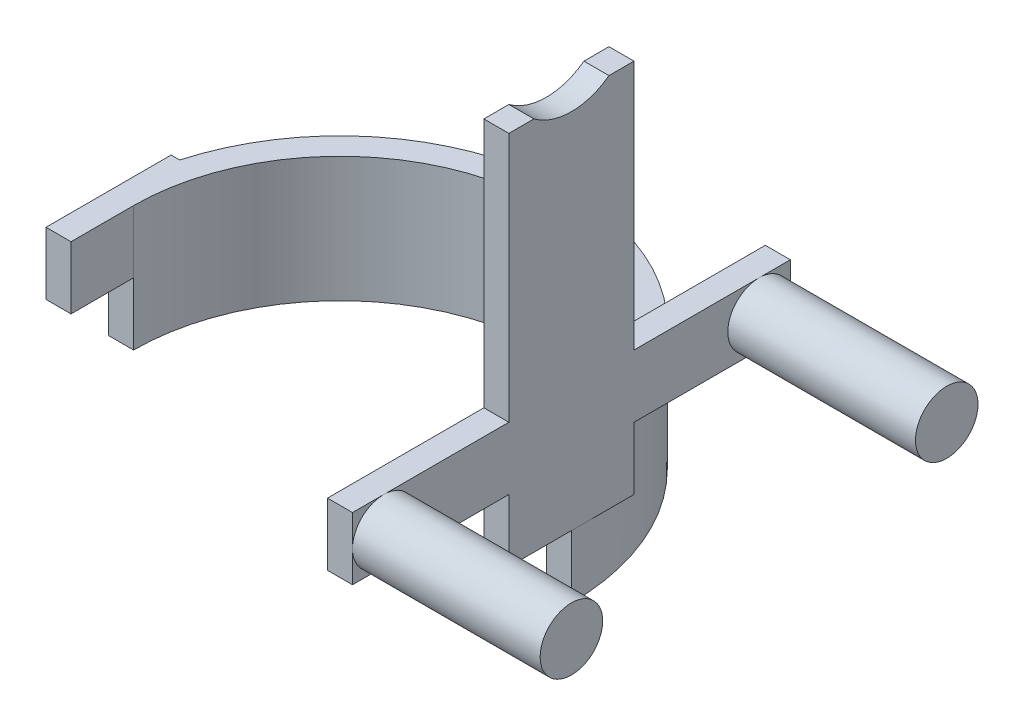
ISO-10303-21;
HEADER;
FILE_DESCRIPTION(('STEP AP214'),'2;1');
FILE_NAME('part.step','',(''),(''),'','','');
FILE_SCHEMA(('AUTOMOTIVE_DESIGN { 1 0 10303 214 1 1 1 1 }'));
ENDSEC;
DATA;
#1=APPLICATION_CONTEXT('core data for automotive mechanical design processes');
#2=APPLICATION_PROTOCOL_DEFINITION('international standard','automotive_design',2000,#1);
#3=PRODUCT_CONTEXT('',#1,'mechanical');
#4=PRODUCT('Part','Part','',(#3));
#5=PRODUCT_RELATED_PRODUCT_CATEGORY('part','',(#4));
#6=PRODUCT_DEFINITION_FORMATION('','',#4);
#7=PRODUCT_DEFINITION_CONTEXT('part definition',#1,'design');
#8=PRODUCT_DEFINITION('design','',#6,#7);
#9=PRODUCT_DEFINITION_SHAPE('','',#8);
#10=(LENGTH_UNIT() NAMED_UNIT(*) SI_UNIT(.MILLI.,.METRE.));
#11=(NAMED_UNIT(*) PLANE_ANGLE_UNIT() SI_UNIT($,.RADIAN.));
#12=(NAMED_UNIT(*) SI_UNIT($,.STERADIAN.) SOLID_ANGLE_UNIT());
#13=UNCERTAINTY_MEASURE_WITH_UNIT(LENGTH_MEASURE(1.E-05),#10,'distance_accuracy_value','');
#14=(GEOMETRIC_REPRESENTATION_CONTEXT(3) GLOBAL_UNCERTAINTY_ASSIGNED_CONTEXT((#13)) GLOBAL_UNIT_ASSIGNED_CONTEXT((#10,
#11,#12)) REPRESENTATION_CONTEXT('',''));
#15=CARTESIAN_POINT('',(0.,0.,0.));
#16=DIRECTION('',(0.,0.,1.));
#17=DIRECTION('',(1.,0.,0.));
#18=AXIS2_PLACEMENT_3D('',#15,#16,#17);
#19=CARTESIAN_POINT('',(74.,40.,-20.));
#20=DIRECTION('',(-1.,0.,0.));
#21=DIRECTION('',(0.,0.,1.));
#22=AXIS2_PLACEMENT_3D('',#19,#20,#21);
#23=PLANE('',#22);
#24=CARTESIAN_POINT('',(74.,50.,-60.));
#25=DIRECTION('',(1.,0.,0.));
#26=DIRECTION('',(0.,0.,-1.));
#27=AXIS2_PLACEMENT_3D('',#24,#25,#26);
#28=CIRCLE('',#27,9.99999999999999);
#29=CARTESIAN_POINT('',(74.,40.,-60.));
#30=VERTEX_POINT('',#29);
#31=CARTESIAN_POINT('',(74.,50.,-70.));
#32=VERTEX_POINT('',#31);
#33=EDGE_CURVE('E238',#30,#32,#28,.T.);
#34=ORIENTED_EDGE('',*,*,#33,.F.);
#35=DIRECTION('',(0.,0.,-1.));
#36=VECTOR('',#35,1.);
#37=CARTESIAN_POINT('',(74.,40.,-70.));
#38=LINE('',#37,#36);
#39=CARTESIAN_POINT('',(74.,40.,-70.));
#40=VERTEX_POINT('',#39);
#41=EDGE_CURVE('E224',#30,#40,#38,.T.);
#42=ORIENTED_EDGE('',*,*,#41,.T.);
#43=DIRECTION('',(0.,1.,0.));
#44=VECTOR('',#43,1.);
#45=CARTESIAN_POINT('',(74.,40.,-70.));
#46=LINE('',#45,#44);
#47=EDGE_CURVE('E239',#40,#32,#46,.T.);
#48=ORIENTED_EDGE('',*,*,#47,.T.);
#49=EDGE_LOOP('',(#34,#42,#48));
#50=FACE_BOUND('',#49,.T.);
#51=ADVANCED_FACE('F39',(#50),#23,.F.);
#52=CARTESIAN_POINT('',(74.,60.,-60.));
#53=VERTEX_POINT('',#52);
#54=EDGE_CURVE('E55',#32,#53,#28,.T.);
#55=ORIENTED_EDGE('',*,*,#54,.F.);
#56=CARTESIAN_POINT('',(74.,60.,-70.));
#57=VERTEX_POINT('',#56);
#58=EDGE_CURVE('E253',#32,#57,#46,.T.);
#59=ORIENTED_EDGE('',*,*,#58,.T.);
#60=DIRECTION('',(0.,0.,1.));
#61=VECTOR('',#60,1.);
#62=CARTESIAN_POINT('',(74.,60.,-70.));
#63=LINE('',#62,#61);
#64=EDGE_CURVE('E281',#57,#53,#63,.T.);
#65=ORIENTED_EDGE('',*,*,#64,.T.);
#66=EDGE_LOOP('',(#55,#59,#65));
#67=FACE_BOUND('',#66,.T.);
#68=ADVANCED_FACE('F547',(#67),#23,.F.);
#69=CARTESIAN_POINT('',(74.,50.,60.));
#70=DIRECTION('',(1.,0.,0.));
#71=DIRECTION('',(0.,0.,-1.));
#72=AXIS2_PLACEMENT_3D('',#69,#70,#71);
#73=CIRCLE('',#72,10.);
#74=CARTESIAN_POINT('',(74.,50.,70.));
#75=VERTEX_POINT('',#74);
#76=CARTESIAN_POINT('',(74.,40.,60.));
#77=VERTEX_POINT('',#76);
#78=EDGE_CURVE('E258',#75,#77,#73,.T.);
#79=ORIENTED_EDGE('',*,*,#78,.F.);
#80=DIRECTION('',(0.,-1.,0.));
#81=VECTOR('',#80,1.);
#82=CARTESIAN_POINT('',(74.,40.,70.));
#83=LINE('',#82,#81);
#84=CARTESIAN_POINT('',(74.,40.,70.));
#85=VERTEX_POINT('',#84);
#86=EDGE_CURVE('E284',#75,#85,#83,.T.);
#87=ORIENTED_EDGE('',*,*,#86,.T.);
#88=EDGE_CURVE('E226',#85,#77,#38,.T.);
#89=ORIENTED_EDGE('',*,*,#88,.T.);
#90=EDGE_LOOP('',(#79,#87,#89));
#91=FACE_BOUND('',#90,.T.);
#92=ADVANCED_FACE('F554',(#91),#23,.F.);
#93=EDGE_CURVE('E63',#53,#30,#28,.T.);
#94=ORIENTED_EDGE('',*,*,#93,.F.);
#95=CARTESIAN_POINT('',(74.,60.,-20.));
#96=VERTEX_POINT('',#95);
#97=EDGE_CURVE('E285',#53,#96,#63,.T.);
#98=ORIENTED_EDGE('',*,*,#97,.T.);
#99=DIRECTION('',(0.,-1.,0.));
#100=VECTOR('',#99,1.);
#101=CARTESIAN_POINT('',(74.,40.,-20.));
#102=LINE('',#101,#100);
#103=CARTESIAN_POINT('',(74.,140.,-20.));
#104=VERTEX_POINT('',#103);
#105=EDGE_CURVE('E464',#104,#96,#102,.T.);
#106=ORIENTED_EDGE('',*,*,#105,.F.);
#107=DIRECTION('',(0.,0.,-1.));
#108=VECTOR('',#107,1.);
#109=CARTESIAN_POINT('',(74.,140.,20.));
#110=LINE('',#109,#108);
#111=CARTESIAN_POINT('',(74.,140.,-12.));
#112=VERTEX_POINT('',#111);
#113=EDGE_CURVE('E410',#112,#104,#110,.T.);
#114=ORIENTED_EDGE('',*,*,#113,.F.);
#115=CARTESIAN_POINT('',(74.,156.,0.));
#116=DIRECTION('',(-1.,0.,0.));
#117=DIRECTION('',(0.,0.,1.));
#118=AXIS2_PLACEMENT_3D('',#115,#116,#117);
#119=CIRCLE('',#118,20.);
#120=CARTESIAN_POINT('',(74.,140.,12.));
#121=VERTEX_POINT('',#120);
#122=EDGE_CURVE('E392',#112,#121,#119,.T.);
#123=ORIENTED_EDGE('',*,*,#122,.T.);
#124=CARTESIAN_POINT('',(74.,140.,20.));
#125=VERTEX_POINT('',#124);
#126=EDGE_CURVE('E411',#125,#121,#110,.T.);
#127=ORIENTED_EDGE('',*,*,#126,.F.);
#128=DIRECTION('',(0.,-1.,0.));
#129=VECTOR('',#128,1.);
#130=CARTESIAN_POINT('',(74.,40.,20.));
#131=LINE('',#130,#129);
#132=CARTESIAN_POINT('',(74.,60.,20.));
#133=VERTEX_POINT('',#132);
#134=EDGE_CURVE('E469',#125,#133,#131,.T.);
#135=ORIENTED_EDGE('',*,*,#134,.T.);
#136=CARTESIAN_POINT('',(74.,60.,60.));
#137=VERTEX_POINT('',#136);
#138=EDGE_CURVE('E286',#133,#137,#63,.T.);
#139=ORIENTED_EDGE('',*,*,#138,.T.);
#140=EDGE_CURVE('E259',#77,#137,#73,.T.);
#141=ORIENTED_EDGE('',*,*,#140,.F.);
#142=CARTESIAN_POINT('',(74.,40.,20.));
#143=VERTEX_POINT('',#142);
#144=EDGE_CURVE('E223',#77,#143,#38,.T.);
#145=ORIENTED_EDGE('',*,*,#144,.T.);
#146=CARTESIAN_POINT('',(74.,20.,20.));
#147=VERTEX_POINT('',#146);
#148=EDGE_CURVE('E468',#143,#147,#131,.T.);
#149=ORIENTED_EDGE('',*,*,#148,.T.);
#150=DIRECTION('',(0.,0.,1.));
#151=VECTOR('',#150,1.);
#152=CARTESIAN_POINT('',(74.,20.,-20.));
#153=LINE('',#152,#151);
#154=CARTESIAN_POINT('',(74.,20.,0.));
#155=VERTEX_POINT('',#154);
#156=EDGE_CURVE('E381',#155,#147,#153,.T.);
#157=ORIENTED_EDGE('',*,*,#156,.F.);
#158=CARTESIAN_POINT('',(74.,20.,-20.));
#159=VERTEX_POINT('',#158);
#160=EDGE_CURVE('E378',#159,#155,#153,.T.);
#161=ORIENTED_EDGE('',*,*,#160,.F.);
#162=CARTESIAN_POINT('',(74.,40.,-20.));
#163=VERTEX_POINT('',#162);
#164=EDGE_CURVE('E219',#163,#159,#102,.T.);
#165=ORIENTED_EDGE('',*,*,#164,.F.);
#166=EDGE_CURVE('E215',#163,#30,#38,.T.);
#167=ORIENTED_EDGE('',*,*,#166,.T.);
#168=EDGE_LOOP('',(#94,#98,#106,#114,#123,#127,#135,#139,#141,#145,#149,#157,#161,#165,#167));
#169=FACE_BOUND('',#168,.T.);
#170=ADVANCED_FACE('F217',(#169),#23,.F.);
#171=CARTESIAN_POINT('',(74.,40.,20.));
#172=DIRECTION('',(0.,0.,-1.));
#173=DIRECTION('',(-1.,0.,0.));
#174=AXIS2_PLACEMENT_3D('',#171,#172,#173);
#175=PLANE('',#174);
#176=ORIENTED_EDGE('',*,*,#148,.F.);
#177=DIRECTION('',(-1.,0.,0.));
#178=VECTOR('',#177,1.);
#179=CARTESIAN_POINT('',(74.,40.,20.));
#180=LINE('',#179,#178);
#181=CARTESIAN_POINT('',(66.,40.,20.));
#182=VERTEX_POINT('',#181);
#183=EDGE_CURVE('E307',#143,#182,#180,.T.);
#184=ORIENTED_EDGE('',*,*,#183,.T.);
#185=DIRECTION('',(0.,-1.,0.));
#186=VECTOR('',#185,1.);
#187=CARTESIAN_POINT('',(66.,40.,20.));
#188=LINE('',#187,#186);
#189=CARTESIAN_POINT('',(66.,20.,20.));
#190=VERTEX_POINT('',#189);
#191=EDGE_CURVE('E473',#182,#190,#188,.T.);
#192=ORIENTED_EDGE('',*,*,#191,.T.);
#193=DIRECTION('',(1.,0.,0.));
#194=VECTOR('',#193,1.);
#195=CARTESIAN_POINT('',(71.2460525222275,20.,20.));
#196=LINE('',#195,#194);
#197=EDGE_CURVE('E342',#190,#147,#196,.T.);
#198=ORIENTED_EDGE('',*,*,#197,.T.);
#199=EDGE_LOOP('',(#176,#184,#192,#198));
#200=FACE_BOUND('',#199,.T.);
#201=ADVANCED_FACE('F572',(#200),#175,.F.);
#202=CARTESIAN_POINT('',(74.,40.,-20.));
#203=DIRECTION('',(0.,0.,1.));
#204=DIRECTION('',(1.,0.,0.));
#205=AXIS2_PLACEMENT_3D('',#202,#203,#204);
#206=PLANE('',#205);
#207=DIRECTION('',(0.,-1.,0.));
#208=VECTOR('',#207,1.);
#209=CARTESIAN_POINT('',(71.2460525222275,40.,-20.));
#210=LINE('',#209,#208);
#211=CARTESIAN_POINT('',(71.2460525222275,40.,-20.));
#212=VERTEX_POINT('',#211);
#213=CARTESIAN_POINT('',(71.2460525222275,20.,-20.));
#214=VERTEX_POINT('',#213);
#215=EDGE_CURVE('E460',#212,#214,#210,.T.);
#216=ORIENTED_EDGE('',*,*,#215,.F.);
#217=DIRECTION('',(1.,0.,0.));
#218=VECTOR('',#217,1.);
#219=CARTESIAN_POINT('',(74.,40.,-20.));
#220=LINE('',#219,#218);
#221=EDGE_CURVE('E293',#212,#163,#220,.T.);
#222=ORIENTED_EDGE('',*,*,#221,.T.);
#223=ORIENTED_EDGE('',*,*,#164,.T.);
#224=DIRECTION('',(1.,0.,0.));
#225=VECTOR('',#224,1.);
#226=CARTESIAN_POINT('',(74.,20.,-20.));
#227=LINE('',#226,#225);
#228=EDGE_CURVE('E374',#214,#159,#227,.T.);
#229=ORIENTED_EDGE('',*,*,#228,.F.);
#230=EDGE_LOOP('',(#216,#222,#223,#229));
#231=FACE_BOUND('',#230,.T.);
#232=ADVANCED_FACE('F568',(#231),#206,.F.);
#233=CARTESIAN_POINT('',(0.,40.,0.));
#234=DIRECTION('',(0.,1.,0.));
#235=DIRECTION('',(0.,0.,1.));
#236=AXIS2_PLACEMENT_3D('',#233,#234,#235);
#237=PLANE('',#236);
#238=DIRECTION('',(0.,0.,1.));
#239=VECTOR('',#238,1.);
#240=CARTESIAN_POINT('',(66.,40.,20.));
#241=LINE('',#240,#239);
#242=CARTESIAN_POINT('',(66.,40.,-33.466401061363));
#243=VERTEX_POINT('',#242);
#244=CARTESIAN_POINT('',(66.,40.,0.));
#245=VERTEX_POINT('',#244);
#246=EDGE_CURVE('E400',#243,#245,#241,.T.);
#247=ORIENTED_EDGE('',*,*,#246,.F.);
#248=CARTESIAN_POINT('',(0.,40.,0.));
#249=DIRECTION('',(0.,1.,0.));
#250=DIRECTION('',(0.,0.,1.));
#251=AXIS2_PLACEMENT_3D('',#248,#249,#250);
#252=CIRCLE('',#251,74.);
#253=CARTESIAN_POINT('',(-71.2460525222275,40.,-20.));
#254=VERTEX_POINT('',#253);
#255=EDGE_CURVE('E429',#243,#254,#252,.T.);
#256=ORIENTED_EDGE('',*,*,#255,.T.);
#257=DIRECTION('',(-1.,0.,0.));
#258=VECTOR('',#257,1.);
#259=CARTESIAN_POINT('',(-64.,40.,-20.));
#260=LINE('',#259,#258);
#261=CARTESIAN_POINT('',(-74.,40.,-20.));
#262=VERTEX_POINT('',#261);
#263=EDGE_CURVE('E385',#254,#262,#260,.T.);
#264=ORIENTED_EDGE('',*,*,#263,.T.);
#265=DIRECTION('',(0.,0.,1.));
#266=VECTOR('',#265,1.);
#267=CARTESIAN_POINT('',(-74.,40.,-20.));
#268=LINE('',#267,#266);
#269=CARTESIAN_POINT('',(-74.,40.,20.));
#270=VERTEX_POINT('',#269);
#271=EDGE_CURVE('E382',#262,#270,#268,.T.);
#272=ORIENTED_EDGE('',*,*,#271,.T.);
#273=DIRECTION('',(-1.,0.,0.));
#274=VECTOR('',#273,1.);
#275=CARTESIAN_POINT('',(-74.,40.,20.));
#276=LINE('',#275,#274);
#277=CARTESIAN_POINT('',(-66.,40.,20.));
#278=VERTEX_POINT('',#277);
#279=EDGE_CURVE('E388',#278,#270,#276,.T.);
#280=ORIENTED_EDGE('',*,*,#279,.F.);
#281=DIRECTION('',(0.,0.,1.));
#282=VECTOR('',#281,1.);
#283=CARTESIAN_POINT('',(-66.,40.,0.));
#284=LINE('',#283,#282);
#285=CARTESIAN_POINT('',(-66.,40.,0.));
#286=VERTEX_POINT('',#285);
#287=EDGE_CURVE('E48',#286,#278,#284,.T.);
#288=ORIENTED_EDGE('',*,*,#287,.F.);
#289=CARTESIAN_POINT('',(0.,40.,0.));
#290=DIRECTION('',(0.,-1.,0.));
#291=DIRECTION('',(0.,0.,1.));
#292=AXIS2_PLACEMENT_3D('',#289,#290,#291);
#293=CIRCLE('',#292,66.);
#294=EDGE_CURVE('E426',#286,#245,#293,.T.);
#295=ORIENTED_EDGE('',*,*,#294,.T.);
#296=EDGE_LOOP('',(#247,#256,#264,#272,#280,#288,#295));
#297=FACE_BOUND('',#296,.T.);
#298=ADVANCED_FACE('F674',(#297),#237,.T.);
#299=CARTESIAN_POINT('',(66.,40.,0.));
#300=DIRECTION('',(1.,0.,0.));
#301=DIRECTION('',(0.,0.,-1.));
#302=AXIS2_PLACEMENT_3D('',#299,#300,#301);
#303=PLANE('',#302);
#304=DIRECTION('',(0.,-1.,0.));
#305=VECTOR('',#304,1.);
#306=CARTESIAN_POINT('',(66.,140.,-20.));
#307=LINE('',#306,#305);
#308=CARTESIAN_POINT('',(66.,140.,-20.));
#309=VERTEX_POINT('',#308);
#310=CARTESIAN_POINT('',(66.,60.,-20.));
#311=VERTEX_POINT('',#310);
#312=EDGE_CURVE('E418',#309,#311,#307,.T.);
#313=ORIENTED_EDGE('',*,*,#312,.T.);
#314=DIRECTION('',(0.,0.,1.));
#315=VECTOR('',#314,1.);
#316=CARTESIAN_POINT('',(66.,60.,-70.));
#317=LINE('',#316,#315);
#318=CARTESIAN_POINT('',(66.,60.,-70.));
#319=VERTEX_POINT('',#318);
#320=EDGE_CURVE('E265',#319,#311,#317,.T.);
#321=ORIENTED_EDGE('',*,*,#320,.F.);
#322=DIRECTION('',(0.,1.,0.));
#323=VECTOR('',#322,1.);
#324=CARTESIAN_POINT('',(66.,40.,-70.));
#325=LINE('',#324,#323);
#326=CARTESIAN_POINT('',(66.,40.,-70.));
#327=VERTEX_POINT('',#326);
#328=EDGE_CURVE('E260',#327,#319,#325,.T.);
#329=ORIENTED_EDGE('',*,*,#328,.F.);
#330=DIRECTION('',(0.,0.,-1.));
#331=VECTOR('',#330,1.);
#332=CARTESIAN_POINT('',(66.,40.,-70.));
#333=LINE('',#332,#331);
#334=EDGE_CURVE('E273',#243,#327,#333,.T.);
#335=ORIENTED_EDGE('',*,*,#334,.F.);
#336=ORIENTED_EDGE('',*,*,#246,.T.);
#337=DIRECTION('',(0.,-1.,0.));
#338=VECTOR('',#337,1.);
#339=CARTESIAN_POINT('',(66.,40.,0.));
#340=LINE('',#339,#338);
#341=CARTESIAN_POINT('',(66.,20.,0.));
#342=VERTEX_POINT('',#341);
#343=EDGE_CURVE('E478',#245,#342,#340,.T.);
#344=ORIENTED_EDGE('',*,*,#343,.T.);
#345=DIRECTION('',(0.,0.,1.));
#346=VECTOR('',#345,1.);
#347=CARTESIAN_POINT('',(66.,20.,20.));
#348=LINE('',#347,#346);
#349=EDGE_CURVE('E338',#342,#190,#348,.T.);
#350=ORIENTED_EDGE('',*,*,#349,.T.);
#351=ORIENTED_EDGE('',*,*,#191,.F.);
#352=CARTESIAN_POINT('',(66.,40.,70.));
#353=VERTEX_POINT('',#352);
#354=EDGE_CURVE('E274',#353,#182,#333,.T.);
#355=ORIENTED_EDGE('',*,*,#354,.F.);
#356=DIRECTION('',(0.,-1.,0.));
#357=VECTOR('',#356,1.);
#358=CARTESIAN_POINT('',(66.,40.,70.));
#359=LINE('',#358,#357);
#360=CARTESIAN_POINT('',(66.,60.,70.));
#361=VERTEX_POINT('',#360);
#362=EDGE_CURVE('E269',#361,#353,#359,.T.);
#363=ORIENTED_EDGE('',*,*,#362,.F.);
#364=CARTESIAN_POINT('',(66.,60.,20.));
#365=VERTEX_POINT('',#364);
#366=EDGE_CURVE('E264',#365,#361,#317,.T.);
#367=ORIENTED_EDGE('',*,*,#366,.F.);
#368=CARTESIAN_POINT('',(66.,140.,20.));
#369=VERTEX_POINT('',#368);
#370=EDGE_CURVE('E474',#369,#365,#188,.T.);
#371=ORIENTED_EDGE('',*,*,#370,.F.);
#372=DIRECTION('',(0.,0.,1.));
#373=VECTOR('',#372,1.);
#374=CARTESIAN_POINT('',(66.,140.,20.));
#375=LINE('',#374,#373);
#376=CARTESIAN_POINT('',(66.,140.,12.));
#377=VERTEX_POINT('',#376);
#378=EDGE_CURVE('E406',#377,#369,#375,.T.);
#379=ORIENTED_EDGE('',*,*,#378,.F.);
#380=CARTESIAN_POINT('',(66.,156.,0.));
#381=DIRECTION('',(1.,0.,0.));
#382=DIRECTION('',(0.,0.,-1.));
#383=AXIS2_PLACEMENT_3D('',#380,#381,#382);
#384=CIRCLE('',#383,20.);
#385=CARTESIAN_POINT('',(66.,140.,-12.));
#386=VERTEX_POINT('',#385);
#387=EDGE_CURVE('E396',#377,#386,#384,.T.);
#388=ORIENTED_EDGE('',*,*,#387,.T.);
#389=EDGE_CURVE('E401',#309,#386,#375,.T.);
#390=ORIENTED_EDGE('',*,*,#389,.F.);
#391=EDGE_LOOP('',(#313,#321,#329,#335,#336,#344,#350,#351,#355,#363,#367,#371,#379,#388,#390));
#392=FACE_BOUND('',#391,.T.);
#393=ADVANCED_FACE('F570',(#392),#303,.F.);
#394=ORIENTED_EDGE('',*,*,#370,.T.);
#395=DIRECTION('',(1.,0.,0.));
#396=VECTOR('',#395,1.);
#397=CARTESIAN_POINT('',(74.,60.,20.));
#398=LINE('',#397,#396);
#399=EDGE_CURVE('E311',#365,#133,#398,.T.);
#400=ORIENTED_EDGE('',*,*,#399,.T.);
#401=ORIENTED_EDGE('',*,*,#134,.F.);
#402=DIRECTION('',(1.,0.,0.));
#403=VECTOR('',#402,1.);
#404=CARTESIAN_POINT('',(66.,140.,20.));
#405=LINE('',#404,#403);
#406=EDGE_CURVE('E405',#369,#125,#405,.T.);
#407=ORIENTED_EDGE('',*,*,#406,.F.);
#408=EDGE_LOOP('',(#394,#400,#401,#407));
#409=FACE_BOUND('',#408,.T.);
#410=ADVANCED_FACE('F559',(#409),#175,.F.);
#411=EDGE_CURVE('E254',#137,#75,#73,.T.);
#412=ORIENTED_EDGE('',*,*,#411,.F.);
#413=CARTESIAN_POINT('',(74.,60.,70.));
#414=VERTEX_POINT('',#413);
#415=EDGE_CURVE('E280',#137,#414,#63,.T.);
#416=ORIENTED_EDGE('',*,*,#415,.T.);
#417=EDGE_CURVE('E236',#414,#75,#83,.T.);
#418=ORIENTED_EDGE('',*,*,#417,.T.);
#419=EDGE_LOOP('',(#412,#416,#418));
#420=FACE_BOUND('',#419,.T.);
#421=ADVANCED_FACE('F549',(#420),#23,.F.);
#422=ORIENTED_EDGE('',*,*,#105,.T.);
#423=DIRECTION('',(-1.,0.,0.));
#424=VECTOR('',#423,1.);
#425=CARTESIAN_POINT('',(74.,60.,-20.));
#426=LINE('',#425,#424);
#427=EDGE_CURVE('E11',#96,#311,#426,.T.);
#428=ORIENTED_EDGE('',*,*,#427,.T.);
#429=ORIENTED_EDGE('',*,*,#312,.F.);
#430=DIRECTION('',(-1.,0.,0.));
#431=VECTOR('',#430,1.);
#432=CARTESIAN_POINT('',(66.,140.,-20.));
#433=LINE('',#432,#431);
#434=EDGE_CURVE('E415',#104,#309,#433,.T.);
#435=ORIENTED_EDGE('',*,*,#434,.F.);
#436=EDGE_LOOP('',(#422,#428,#429,#435));
#437=FACE_BOUND('',#436,.T.);
#438=ADVANCED_FACE('F558',(#437),#206,.F.);
#439=CARTESIAN_POINT('',(-74.,40.,-20.));
#440=DIRECTION('',(0.,0.,1.));
#441=DIRECTION('',(1.,0.,0.));
#442=AXIS2_PLACEMENT_3D('',#439,#440,#441);
#443=PLANE('',#442);
#444=DIRECTION('',(1.,0.,0.));
#445=VECTOR('',#444,1.);
#446=CARTESIAN_POINT('',(-74.,20.,-20.));
#447=LINE('',#446,#445);
#448=CARTESIAN_POINT('',(-74.,20.,-20.));
#449=VERTEX_POINT('',#448);
#450=CARTESIAN_POINT('',(-71.2460525222275,20.,-20.));
#451=VERTEX_POINT('',#450);
#452=EDGE_CURVE('E371',#449,#451,#447,.T.);
#453=ORIENTED_EDGE('',*,*,#452,.F.);
#454=DIRECTION('',(0.,-1.,0.));
#455=VECTOR('',#454,1.);
#456=CARTESIAN_POINT('',(-74.,40.,-20.));
#457=LINE('',#456,#455);
#458=EDGE_CURVE('E452',#262,#449,#457,.T.);
#459=ORIENTED_EDGE('',*,*,#458,.F.);
#460=ORIENTED_EDGE('',*,*,#263,.F.);
#461=DIRECTION('',(0.,-1.,0.));
#462=VECTOR('',#461,1.);
#463=CARTESIAN_POINT('',(-71.2460525222275,40.,-20.));
#464=LINE('',#463,#462);
#465=EDGE_CURVE('E456',#254,#451,#464,.T.);
#466=ORIENTED_EDGE('',*,*,#465,.T.);
#467=EDGE_LOOP('',(#453,#459,#460,#466));
#468=FACE_BOUND('',#467,.T.);
#469=ADVANCED_FACE('F566',(#468),#443,.F.);
#470=CARTESIAN_POINT('',(-74.,40.,-20.));
#471=DIRECTION('',(1.,0.,0.));
#472=DIRECTION('',(0.,0.,-1.));
#473=AXIS2_PLACEMENT_3D('',#470,#471,#472);
#474=PLANE('',#473);
#475=DIRECTION('',(0.,0.,-1.));
#476=VECTOR('',#475,1.);
#477=CARTESIAN_POINT('',(-74.,20.,-20.));
#478=LINE('',#477,#476);
#479=CARTESIAN_POINT('',(-74.,20.,20.));
#480=VERTEX_POINT('',#479);
#481=CARTESIAN_POINT('',(-74.,20.,0.));
#482=VERTEX_POINT('',#481);
#483=EDGE_CURVE('E356',#480,#482,#478,.T.);
#484=ORIENTED_EDGE('',*,*,#483,.F.);
#485=DIRECTION('',(0.,-1.,0.));
#486=VECTOR('',#485,1.);
#487=CARTESIAN_POINT('',(-74.,40.,20.));
#488=LINE('',#487,#486);
#489=EDGE_CURVE('E448',#270,#480,#488,.T.);
#490=ORIENTED_EDGE('',*,*,#489,.F.);
#491=ORIENTED_EDGE('',*,*,#271,.F.);
#492=ORIENTED_EDGE('',*,*,#458,.T.);
#493=EDGE_CURVE('E370',#482,#449,#478,.T.);
#494=ORIENTED_EDGE('',*,*,#493,.F.);
#495=EDGE_LOOP('',(#484,#490,#491,#492,#494));
#496=FACE_BOUND('',#495,.T.);
#497=ADVANCED_FACE('F507',(#496),#474,.F.);
#498=CARTESIAN_POINT('',(-74.,40.,20.));
#499=DIRECTION('',(0.,0.,-1.));
#500=DIRECTION('',(-1.,0.,0.));
#501=AXIS2_PLACEMENT_3D('',#498,#499,#500);
#502=PLANE('',#501);
#503=DIRECTION('',(1.,0.,0.));
#504=VECTOR('',#503,1.);
#505=CARTESIAN_POINT('',(-71.2460525222275,20.,20.));
#506=LINE('',#505,#504);
#507=CARTESIAN_POINT('',(-66.,20.,20.));
#508=VERTEX_POINT('',#507);
#509=EDGE_CURVE('E316',#480,#508,#506,.T.);
#510=ORIENTED_EDGE('',*,*,#509,.T.);
#511=DIRECTION('',(0.,-1.,0.));
#512=VECTOR('',#511,1.);
#513=CARTESIAN_POINT('',(-66.,40.,20.));
#514=LINE('',#513,#512);
#515=EDGE_CURVE('E444',#278,#508,#514,.T.);
#516=ORIENTED_EDGE('',*,*,#515,.F.);
#517=ORIENTED_EDGE('',*,*,#279,.T.);
#518=ORIENTED_EDGE('',*,*,#489,.T.);
#519=EDGE_LOOP('',(#510,#516,#517,#518));
#520=FACE_BOUND('',#519,.T.);
#521=ADVANCED_FACE('F498',(#520),#502,.F.);
#522=CARTESIAN_POINT('',(-66.,40.,0.));
#523=DIRECTION('',(-1.,0.,0.));
#524=DIRECTION('',(0.,0.,1.));
#525=AXIS2_PLACEMENT_3D('',#522,#523,#524);
#526=PLANE('',#525);
#527=DIRECTION('',(0.,0.,-1.));
#528=VECTOR('',#527,1.);
#529=CARTESIAN_POINT('',(-66.,20.,20.));
#530=LINE('',#529,#528);
#531=CARTESIAN_POINT('',(-66.,20.,0.));
#532=VERTEX_POINT('',#531);
#533=EDGE_CURVE('E320',#508,#532,#530,.T.);
#534=ORIENTED_EDGE('',*,*,#533,.T.);
#535=DIRECTION('',(0.,-1.,0.));
#536=VECTOR('',#535,1.);
#537=CARTESIAN_POINT('',(-66.,40.,0.));
#538=LINE('',#537,#536);
#539=EDGE_CURVE('E435',#286,#532,#538,.T.);
#540=ORIENTED_EDGE('',*,*,#539,.F.);
#541=ORIENTED_EDGE('',*,*,#287,.T.);
#542=ORIENTED_EDGE('',*,*,#515,.T.);
#543=EDGE_LOOP('',(#534,#540,#541,#542));
#544=FACE_BOUND('',#543,.T.);
#545=ADVANCED_FACE('F494',(#544),#526,.F.);
#546=CARTESIAN_POINT('',(0.,0.,0.));
#547=DIRECTION('',(0.,1.,0.));
#548=DIRECTION('',(0.,0.,1.));
#549=AXIS2_PLACEMENT_3D('',#546,#547,#548);
#550=PLANE('',#549);
#551=DIRECTION('',(-1.,0.,0.));
#552=VECTOR('',#551,1.);
#553=CARTESIAN_POINT('',(74.,0.,0.));
#554=LINE('',#553,#552);
#555=CARTESIAN_POINT('',(74.,0.,0.));
#556=VERTEX_POINT('',#555);
#557=CARTESIAN_POINT('',(66.,0.,0.));
#558=VERTEX_POINT('',#557);
#559=EDGE_CURVE('E321',#556,#558,#554,.T.);
#560=ORIENTED_EDGE('',*,*,#559,.T.);
#561=CARTESIAN_POINT('',(0.,0.,0.));
#562=DIRECTION('',(0.,-1.,0.));
#563=DIRECTION('',(0.,0.,1.));
#564=AXIS2_PLACEMENT_3D('',#561,#562,#563);
#565=CIRCLE('',#564,66.);
#566=CARTESIAN_POINT('',(-66.,0.,0.));
#567=VERTEX_POINT('',#566);
#568=EDGE_CURVE('E425',#567,#558,#565,.T.);
#569=ORIENTED_EDGE('',*,*,#568,.F.);
#570=DIRECTION('',(-1.,0.,0.));
#571=VECTOR('',#570,1.);
#572=CARTESIAN_POINT('',(-74.,0.,0.));
#573=LINE('',#572,#571);
#574=CARTESIAN_POINT('',(-74.,0.,0.));
#575=VERTEX_POINT('',#574);
#576=EDGE_CURVE('E315',#567,#575,#573,.T.);
#577=ORIENTED_EDGE('',*,*,#576,.T.);
#578=CARTESIAN_POINT('',(0.,0.,0.));
#579=DIRECTION('',(0.,1.,0.));
#580=DIRECTION('',(0.,0.,1.));
#581=AXIS2_PLACEMENT_3D('',#578,#579,#580);
#582=CIRCLE('',#581,74.);
#583=EDGE_CURVE('E430',#556,#575,#582,.T.);
#584=ORIENTED_EDGE('',*,*,#583,.F.);
#585=EDGE_LOOP('',(#560,#569,#577,#584));
#586=FACE_BOUND('',#585,.T.);
#587=ADVANCED_FACE('F636',(#586),#550,.F.);
#588=CARTESIAN_POINT('',(0.,140.,0.));
#589=DIRECTION('',(0.,-1.,0.));
#590=DIRECTION('',(0.,0.,-1.));
#591=AXIS2_PLACEMENT_3D('',#588,#589,#590);
#592=PLANE('',#591);
#593=ORIENTED_EDGE('',*,*,#126,.T.);
#594=DIRECTION('',(-1.,0.,0.));
#595=VECTOR('',#594,1.);
#596=CARTESIAN_POINT('',(74.,140.,12.));
#597=LINE('',#596,#595);
#598=EDGE_CURVE('E486',#121,#377,#597,.T.);
#599=ORIENTED_EDGE('',*,*,#598,.T.);
#600=ORIENTED_EDGE('',*,*,#378,.T.);
#601=ORIENTED_EDGE('',*,*,#406,.T.);
#602=EDGE_LOOP('',(#593,#599,#600,#601));
#603=FACE_BOUND('',#602,.T.);
#604=ADVANCED_FACE('F595',(#603),#592,.F.);
#605=CARTESIAN_POINT('',(0.,40.,0.));
#606=DIRECTION('',(0.,-1.,0.));
#607=DIRECTION('',(0.,0.,-1.));
#608=AXIS2_PLACEMENT_3D('',#605,#606,#607);
#609=CYLINDRICAL_SURFACE('',#608,66.);
#610=ORIENTED_EDGE('',*,*,#568,.T.);
#611=DIRECTION('',(0.,-1.,0.));
#612=VECTOR('',#611,1.);
#613=CARTESIAN_POINT('',(66.,20.,0.));
#614=LINE('',#613,#612);
#615=EDGE_CURVE('E353',#342,#558,#614,.T.);
#616=ORIENTED_EDGE('',*,*,#615,.F.);
#617=ORIENTED_EDGE('',*,*,#343,.F.);
#618=ORIENTED_EDGE('',*,*,#294,.F.);
#619=ORIENTED_EDGE('',*,*,#539,.T.);
#620=DIRECTION('',(0.,-1.,0.));
#621=VECTOR('',#620,1.);
#622=CARTESIAN_POINT('',(-66.,20.,0.));
#623=LINE('',#622,#621);
#624=EDGE_CURVE('E346',#532,#567,#623,.T.);
#625=ORIENTED_EDGE('',*,*,#624,.T.);
#626=EDGE_LOOP('',(#610,#616,#617,#618,#619,#625));
#627=FACE_BOUND('',#626,.T.);
#628=ADVANCED_FACE('F41',(#627),#609,.F.);
#629=CARTESIAN_POINT('',(0.,40.,0.));
#630=DIRECTION('',(0.,-1.,0.));
#631=DIRECTION('',(0.,0.,-1.));
#632=AXIS2_PLACEMENT_3D('',#629,#630,#631);
#633=CYLINDRICAL_SURFACE('',#632,74.);
#634=ORIENTED_EDGE('',*,*,#583,.T.);
#635=DIRECTION('',(0.,-1.,0.));
#636=VECTOR('',#635,1.);
#637=CARTESIAN_POINT('',(-74.,20.,0.));
#638=LINE('',#637,#636);
#639=EDGE_CURVE('E361',#482,#575,#638,.T.);
#640=ORIENTED_EDGE('',*,*,#639,.F.);
#641=CARTESIAN_POINT('',(0.,20.,0.));
#642=DIRECTION('',(0.,-1.,0.));
#643=DIRECTION('',(0.,0.,-1.));
#644=AXIS2_PLACEMENT_3D('',#641,#642,#643);
#645=CIRCLE('',#644,74.);
#646=EDGE_CURVE('E330',#482,#451,#645,.T.);
#647=ORIENTED_EDGE('',*,*,#646,.T.);
#648=ORIENTED_EDGE('',*,*,#465,.F.);
#649=ORIENTED_EDGE('',*,*,#255,.F.);
#650=EDGE_CURVE('E431',#212,#243,#252,.T.);
#651=ORIENTED_EDGE('',*,*,#650,.F.);
#652=ORIENTED_EDGE('',*,*,#215,.T.);
#653=EDGE_CURVE('E329',#214,#155,#645,.T.);
#654=ORIENTED_EDGE('',*,*,#653,.T.);
#655=DIRECTION('',(0.,-1.,0.));
#656=VECTOR('',#655,1.);
#657=CARTESIAN_POINT('',(74.,20.,0.));
#658=LINE('',#657,#656);
#659=EDGE_CURVE('E357',#155,#556,#658,.T.);
#660=ORIENTED_EDGE('',*,*,#659,.T.);
#661=EDGE_LOOP('',(#634,#640,#647,#648,#649,#651,#652,#654,#660));
#662=FACE_BOUND('',#661,.T.);
#663=ADVANCED_FACE('F629',(#662),#633,.T.);
#664=ORIENTED_EDGE('',*,*,#389,.T.);
#665=DIRECTION('',(-1.,0.,0.));
#666=VECTOR('',#665,1.);
#667=CARTESIAN_POINT('',(74.,140.,-12.));
#668=LINE('',#667,#666);
#669=EDGE_CURVE('E482',#386,#112,#668,.F.);
#670=ORIENTED_EDGE('',*,*,#669,.T.);
#671=ORIENTED_EDGE('',*,*,#113,.T.);
#672=ORIENTED_EDGE('',*,*,#434,.T.);
#673=EDGE_LOOP('',(#664,#670,#671,#672));
#674=FACE_BOUND('',#673,.T.);
#675=ADVANCED_FACE('F661',(#674),#592,.F.);
#676=CARTESIAN_POINT('',(74.,156.,0.));
#677=DIRECTION('',(-1.,0.,0.));
#678=DIRECTION('',(0.,0.,1.));
#679=AXIS2_PLACEMENT_3D('',#676,#677,#678);
#680=CYLINDRICAL_SURFACE('',#679,20.);
#681=ORIENTED_EDGE('',*,*,#122,.F.);
#682=ORIENTED_EDGE('',*,*,#669,.F.);
#683=ORIENTED_EDGE('',*,*,#387,.F.);
#684=ORIENTED_EDGE('',*,*,#598,.F.);
#685=EDGE_LOOP('',(#681,#682,#683,#684));
#686=FACE_BOUND('',#685,.T.);
#687=ADVANCED_FACE('F663',(#686),#680,.F.);
#688=CARTESIAN_POINT('',(-74.,20.,0.));
#689=DIRECTION('',(0.,0.,1.));
#690=DIRECTION('',(1.,0.,0.));
#691=AXIS2_PLACEMENT_3D('',#688,#689,#690);
#692=PLANE('',#691);
#693=ORIENTED_EDGE('',*,*,#576,.F.);
#694=ORIENTED_EDGE('',*,*,#624,.F.);
#695=DIRECTION('',(-1.,0.,0.));
#696=VECTOR('',#695,1.);
#697=CARTESIAN_POINT('',(-74.,20.,0.));
#698=LINE('',#697,#696);
#699=EDGE_CURVE('E325',#532,#482,#698,.T.);
#700=ORIENTED_EDGE('',*,*,#699,.T.);
#701=ORIENTED_EDGE('',*,*,#639,.T.);
#702=EDGE_LOOP('',(#693,#694,#700,#701));
#703=FACE_BOUND('',#702,.T.);
#704=ADVANCED_FACE('F640',(#703),#692,.T.);
#705=CARTESIAN_POINT('',(0.,20.,0.));
#706=DIRECTION('',(0.,-1.,0.));
#707=DIRECTION('',(0.,0.,-1.));
#708=AXIS2_PLACEMENT_3D('',#705,#706,#707);
#709=PLANE('',#708);
#710=ORIENTED_EDGE('',*,*,#483,.T.);
#711=ORIENTED_EDGE('',*,*,#699,.F.);
#712=ORIENTED_EDGE('',*,*,#533,.F.);
#713=ORIENTED_EDGE('',*,*,#509,.F.);
#714=EDGE_LOOP('',(#710,#711,#712,#713));
#715=FACE_BOUND('',#714,.T.);
#716=ADVANCED_FACE('F502',(#715),#709,.T.);
#717=ORIENTED_EDGE('',*,*,#452,.T.);
#718=ORIENTED_EDGE('',*,*,#646,.F.);
#719=ORIENTED_EDGE('',*,*,#493,.T.);
#720=EDGE_LOOP('',(#717,#718,#719));
#721=FACE_BOUND('',#720,.T.);
#722=ADVANCED_FACE('F642',(#721),#709,.T.);
#723=ORIENTED_EDGE('',*,*,#156,.T.);
#724=ORIENTED_EDGE('',*,*,#197,.F.);
#725=ORIENTED_EDGE('',*,*,#349,.F.);
#726=DIRECTION('',(-1.,0.,0.));
#727=VECTOR('',#726,1.);
#728=CARTESIAN_POINT('',(74.,20.,0.));
#729=LINE('',#728,#727);
#730=EDGE_CURVE('E334',#155,#342,#729,.T.);
#731=ORIENTED_EDGE('',*,*,#730,.F.);
#732=EDGE_LOOP('',(#723,#724,#725,#731));
#733=FACE_BOUND('',#732,.T.);
#734=ADVANCED_FACE('F616',(#733),#709,.T.);
#735=ORIENTED_EDGE('',*,*,#160,.T.);
#736=ORIENTED_EDGE('',*,*,#653,.F.);
#737=ORIENTED_EDGE('',*,*,#228,.T.);
#738=EDGE_LOOP('',(#735,#736,#737));
#739=FACE_BOUND('',#738,.T.);
#740=ADVANCED_FACE('F626',(#739),#709,.T.);
#741=CARTESIAN_POINT('',(74.,20.,0.));
#742=DIRECTION('',(0.,0.,1.));
#743=DIRECTION('',(1.,0.,0.));
#744=AXIS2_PLACEMENT_3D('',#741,#742,#743);
#745=PLANE('',#744);
#746=ORIENTED_EDGE('',*,*,#559,.F.);
#747=ORIENTED_EDGE('',*,*,#659,.F.);
#748=ORIENTED_EDGE('',*,*,#730,.T.);
#749=ORIENTED_EDGE('',*,*,#615,.T.);
#750=EDGE_LOOP('',(#746,#747,#748,#749));
#751=FACE_BOUND('',#750,.T.);
#752=ADVANCED_FACE('F632',(#751),#745,.T.);
#753=CARTESIAN_POINT('',(66.,40.,-70.));
#754=DIRECTION('',(0.,0.,-1.));
#755=DIRECTION('',(-1.,0.,0.));
#756=AXIS2_PLACEMENT_3D('',#753,#754,#755);
#757=PLANE('',#756);
#758=ORIENTED_EDGE('',*,*,#47,.F.);
#759=DIRECTION('',(1.,0.,0.));
#760=VECTOR('',#759,1.);
#761=CARTESIAN_POINT('',(66.,40.,-70.));
#762=LINE('',#761,#760);
#763=EDGE_CURVE('E231',#327,#40,#762,.T.);
#764=ORIENTED_EDGE('',*,*,#763,.F.);
#765=ORIENTED_EDGE('',*,*,#328,.T.);
#766=DIRECTION('',(1.,0.,0.));
#767=VECTOR('',#766,1.);
#768=CARTESIAN_POINT('',(66.,60.,-70.));
#769=LINE('',#768,#767);
#770=EDGE_CURVE('E277',#319,#57,#769,.T.);
#771=ORIENTED_EDGE('',*,*,#770,.T.);
#772=ORIENTED_EDGE('',*,*,#58,.F.);
#773=EDGE_LOOP('',(#758,#764,#765,#771,#772));
#774=FACE_BOUND('',#773,.T.);
#775=ADVANCED_FACE('F650',(#774),#757,.T.);
#776=CARTESIAN_POINT('',(66.,40.,-70.));
#777=DIRECTION('',(0.,-1.,0.));
#778=DIRECTION('',(0.,0.,-1.));
#779=AXIS2_PLACEMENT_3D('',#776,#777,#778);
#780=PLANE('',#779);
#781=ORIENTED_EDGE('',*,*,#221,.F.);
#782=ORIENTED_EDGE('',*,*,#650,.T.);
#783=ORIENTED_EDGE('',*,*,#334,.T.);
#784=ORIENTED_EDGE('',*,*,#763,.T.);
#785=ORIENTED_EDGE('',*,*,#41,.F.);
#786=ORIENTED_EDGE('',*,*,#166,.F.);
#787=EDGE_LOOP('',(#781,#782,#783,#784,#785,#786));
#788=FACE_BOUND('',#787,.T.);
#789=ADVANCED_FACE('F229',(#788),#780,.T.);
#790=CARTESIAN_POINT('',(66.,60.,-70.));
#791=DIRECTION('',(0.,1.,0.));
#792=DIRECTION('',(0.,0.,1.));
#793=AXIS2_PLACEMENT_3D('',#790,#791,#792);
#794=PLANE('',#793);
#795=ORIENTED_EDGE('',*,*,#427,.F.);
#796=ORIENTED_EDGE('',*,*,#97,.F.);
#797=ORIENTED_EDGE('',*,*,#64,.F.);
#798=ORIENTED_EDGE('',*,*,#770,.F.);
#799=ORIENTED_EDGE('',*,*,#320,.T.);
#800=EDGE_LOOP('',(#795,#796,#797,#798,#799));
#801=FACE_BOUND('',#800,.T.);
#802=ADVANCED_FACE('F654',(#801),#794,.T.);
#803=ORIENTED_EDGE('',*,*,#399,.F.);
#804=ORIENTED_EDGE('',*,*,#366,.T.);
#805=DIRECTION('',(1.,0.,0.));
#806=VECTOR('',#805,1.);
#807=CARTESIAN_POINT('',(66.,60.,70.));
#808=LINE('',#807,#806);
#809=EDGE_CURVE('E298',#361,#414,#808,.T.);
#810=ORIENTED_EDGE('',*,*,#809,.T.);
#811=ORIENTED_EDGE('',*,*,#415,.F.);
#812=ORIENTED_EDGE('',*,*,#138,.F.);
#813=EDGE_LOOP('',(#803,#804,#810,#811,#812));
#814=FACE_BOUND('',#813,.T.);
#815=ADVANCED_FACE('F589',(#814),#794,.T.);
#816=ORIENTED_EDGE('',*,*,#183,.F.);
#817=ORIENTED_EDGE('',*,*,#144,.F.);
#818=ORIENTED_EDGE('',*,*,#88,.F.);
#819=DIRECTION('',(1.,0.,0.));
#820=VECTOR('',#819,1.);
#821=CARTESIAN_POINT('',(66.,40.,70.));
#822=LINE('',#821,#820);
#823=EDGE_CURVE('E294',#353,#85,#822,.T.);
#824=ORIENTED_EDGE('',*,*,#823,.F.);
#825=ORIENTED_EDGE('',*,*,#354,.T.);
#826=EDGE_LOOP('',(#816,#817,#818,#824,#825));
#827=FACE_BOUND('',#826,.T.);
#828=ADVANCED_FACE('F607',(#827),#780,.T.);
#829=CARTESIAN_POINT('',(66.,40.,70.));
#830=DIRECTION('',(0.,0.,1.));
#831=DIRECTION('',(1.,0.,0.));
#832=AXIS2_PLACEMENT_3D('',#829,#830,#831);
#833=PLANE('',#832);
#834=ORIENTED_EDGE('',*,*,#417,.F.);
#835=ORIENTED_EDGE('',*,*,#809,.F.);
#836=ORIENTED_EDGE('',*,*,#362,.T.);
#837=ORIENTED_EDGE('',*,*,#823,.T.);
#838=ORIENTED_EDGE('',*,*,#86,.F.);
#839=EDGE_LOOP('',(#834,#835,#836,#837,#838));
#840=FACE_BOUND('',#839,.T.);
#841=ADVANCED_FACE('F604',(#840),#833,.T.);
#842=CARTESIAN_POINT('',(134.,50.,60.));
#843=DIRECTION('',(-1.,0.,0.));
#844=DIRECTION('',(0.,0.,1.));
#845=AXIS2_PLACEMENT_3D('',#842,#843,#844);
#846=CYLINDRICAL_SURFACE('',#845,10.);
#847=CARTESIAN_POINT('',(134.,50.,60.));
#848=DIRECTION('',(1.,0.,0.));
#849=DIRECTION('',(0.,0.,-1.));
#850=AXIS2_PLACEMENT_3D('',#847,#848,#849);
#851=CIRCLE('',#850,10.);
#852=CARTESIAN_POINT('',(134.,50.,50.));
#853=VERTEX_POINT('',#852);
#854=EDGE_CURVE('E249',#853,#853,#851,.T.);
#855=ORIENTED_EDGE('',*,*,#854,.F.);
#856=EDGE_LOOP('',(#855));
#857=FACE_BOUND('',#856,.T.);
#858=ORIENTED_EDGE('',*,*,#411,.T.);
#859=ORIENTED_EDGE('',*,*,#78,.T.);
#860=ORIENTED_EDGE('',*,*,#140,.T.);
#861=EDGE_LOOP('',(#858,#859,#860));
#862=FACE_BOUND('',#861,.T.);
#863=ADVANCED_FACE('F543',(#857,#862),#846,.T.);
#864=CARTESIAN_POINT('',(134.,50.,60.));
#865=DIRECTION('',(1.,0.,0.));
#866=DIRECTION('',(0.,0.,-1.));
#867=AXIS2_PLACEMENT_3D('',#864,#865,#866);
#868=PLANE('',#867);
#869=ORIENTED_EDGE('',*,*,#854,.T.);
#870=EDGE_LOOP('',(#869));
#871=FACE_BOUND('',#870,.T.);
#872=ADVANCED_FACE('F536',(#871),#868,.T.);
#873=CARTESIAN_POINT('',(134.,50.,-60.));
#874=DIRECTION('',(-1.,0.,0.));
#875=DIRECTION('',(0.,0.,1.));
#876=AXIS2_PLACEMENT_3D('',#873,#874,#875);
#877=CYLINDRICAL_SURFACE('',#876,9.99999999999999);
#878=CARTESIAN_POINT('',(134.,50.,-60.));
#879=DIRECTION('',(1.,0.,0.));
#880=DIRECTION('',(0.,0.,-1.));
#881=AXIS2_PLACEMENT_3D('',#878,#879,#880);
#882=CIRCLE('',#881,9.99999999999999);
#883=CARTESIAN_POINT('',(134.,50.,-70.));
#884=VERTEX_POINT('',#883);
#885=EDGE_CURVE('E246',#884,#884,#882,.T.);
#886=ORIENTED_EDGE('',*,*,#885,.F.);
#887=EDGE_LOOP('',(#886));
#888=FACE_BOUND('',#887,.T.);
#889=ORIENTED_EDGE('',*,*,#54,.T.);
#890=ORIENTED_EDGE('',*,*,#93,.T.);
#891=ORIENTED_EDGE('',*,*,#33,.T.);
#892=EDGE_LOOP('',(#889,#890,#891));
#893=FACE_BOUND('',#892,.T.);
#894=ADVANCED_FACE('F243',(#888,#893),#877,.T.);
#895=CARTESIAN_POINT('',(134.,50.,-60.));
#896=DIRECTION('',(1.,0.,0.));
#897=DIRECTION('',(0.,0.,-1.));
#898=AXIS2_PLACEMENT_3D('',#895,#896,#897);
#899=PLANE('',#898);
#900=ORIENTED_EDGE('',*,*,#885,.T.);
#901=EDGE_LOOP('',(#900));
#902=FACE_BOUND('',#901,.T.);
#903=ADVANCED_FACE('F533',(#902),#899,.T.);
#904=CLOSED_SHELL('',(#51,#68,#92,#170,#201,#232,#298,#393,#410,#421,#438,#469,#497,#521,#545,
#587,#604,#628,#663,#675,#687,#704,#716,#722,#734,#740,#752,#775,#789,#802,#815,#828,#841,#863,
#872,#894,#903));
#905=MANIFOLD_SOLID_BREP('B2',#904);
#906=ADVANCED_BREP_SHAPE_REPRESENTATION('',(#18,#905),#14);
#907=SHAPE_DEFINITION_REPRESENTATION(#9,#906);
ENDSEC;
END-ISO-10303-21;
